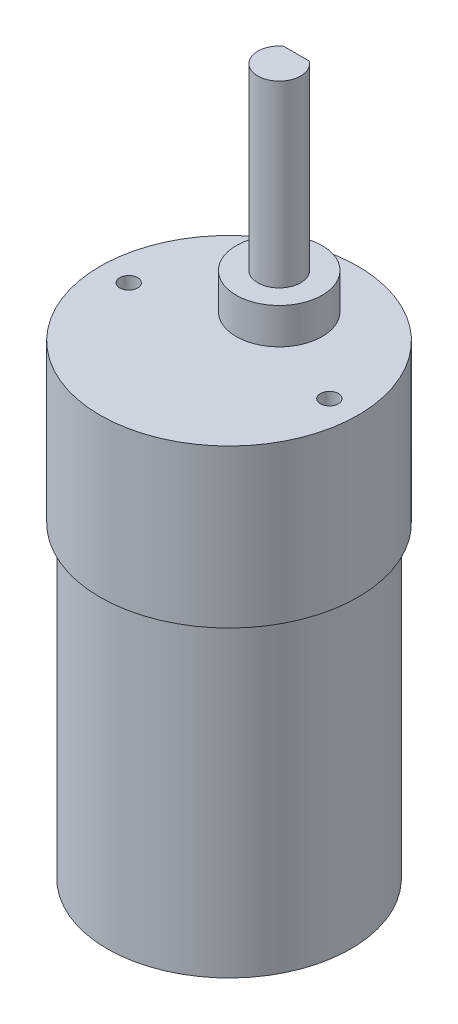
ISO-10303-21;
HEADER;
FILE_DESCRIPTION(('STEP AP214'),'2;1');
FILE_NAME('part.step','',(''),(''),'','','');
FILE_SCHEMA(('AUTOMOTIVE_DESIGN { 1 0 10303 214 1 1 1 1 }'));
ENDSEC;
DATA;
#1=APPLICATION_CONTEXT('core data for automotive mechanical design processes');
#2=APPLICATION_PROTOCOL_DEFINITION('international standard','automotive_design',2000,#1);
#3=PRODUCT_CONTEXT('',#1,'mechanical');
#4=PRODUCT('Part','Part','',(#3));
#5=PRODUCT_RELATED_PRODUCT_CATEGORY('part','',(#4));
#6=PRODUCT_DEFINITION_FORMATION('','',#4);
#7=PRODUCT_DEFINITION_CONTEXT('part definition',#1,'design');
#8=PRODUCT_DEFINITION('design','',#6,#7);
#9=PRODUCT_DEFINITION_SHAPE('','',#8);
#10=(LENGTH_UNIT() NAMED_UNIT(*) SI_UNIT(.MILLI.,.METRE.));
#11=(NAMED_UNIT(*) PLANE_ANGLE_UNIT() SI_UNIT($,.RADIAN.));
#12=(NAMED_UNIT(*) SI_UNIT($,.STERADIAN.) SOLID_ANGLE_UNIT());
#13=UNCERTAINTY_MEASURE_WITH_UNIT(LENGTH_MEASURE(1.E-05),#10,'distance_accuracy_value','');
#14=(GEOMETRIC_REPRESENTATION_CONTEXT(3) GLOBAL_UNCERTAINTY_ASSIGNED_CONTEXT((#13)) GLOBAL_UNIT_ASSIGNED_CONTEXT((#10,
#11,#12)) REPRESENTATION_CONTEXT('',''));
#15=CARTESIAN_POINT('',(0.,0.,0.));
#16=DIRECTION('',(0.,0.,1.));
#17=DIRECTION('',(1.,0.,0.));
#18=AXIS2_PLACEMENT_3D('',#15,#16,#17);
#19=CARTESIAN_POINT('',(0.,-1.,0.));
#20=DIRECTION('',(0.,-1.,0.));
#21=DIRECTION('',(0.,0.,-1.));
#22=AXIS2_PLACEMENT_3D('',#19,#20,#21);
#23=PLANE('',#22);
#24=CARTESIAN_POINT('',(0.,-1.,0.));
#25=DIRECTION('',(0.,-1.,0.));
#26=DIRECTION('',(0.,0.,-1.));
#27=AXIS2_PLACEMENT_3D('',#24,#25,#26);
#28=CIRCLE('',#27,5.);
#29=CARTESIAN_POINT('',(0.,-1.,-5.));
#30=VERTEX_POINT('',#29);
#31=EDGE_CURVE('E393',#30,#30,#28,.T.);
#32=ORIENTED_EDGE('',*,*,#31,.T.);
#33=EDGE_LOOP('',(#32));
#34=FACE_BOUND('',#33,.T.);
#35=CARTESIAN_POINT('',(0.,-1.,0.));
#36=DIRECTION('',(0.,-1.,0.));
#37=DIRECTION('',(0.,0.,-1.));
#38=AXIS2_PLACEMENT_3D('',#35,#36,#37);
#39=CIRCLE('',#38,3.25);
#40=CARTESIAN_POINT('',(0.,-1.,-3.25));
#41=VERTEX_POINT('',#40);
#42=EDGE_CURVE('E394',#41,#41,#39,.T.);
#43=ORIENTED_EDGE('',*,*,#42,.F.);
#44=EDGE_LOOP('',(#43));
#45=FACE_BOUND('',#44,.T.);
#46=ADVANCED_FACE('F33',(#34,#45),#23,.T.);
#47=CARTESIAN_POINT('',(0.,0.,0.));
#48=DIRECTION('',(0.,1.,0.));
#49=DIRECTION('',(0.,0.,1.));
#50=AXIS2_PLACEMENT_3D('',#47,#48,#49);
#51=PLANE('',#50);
#52=CARTESIAN_POINT('',(0.,0.,0.));
#53=DIRECTION('',(0.,1.,0.));
#54=DIRECTION('',(0.,0.,1.));
#55=AXIS2_PLACEMENT_3D('',#52,#53,#54);
#56=CIRCLE('',#55,17.);
#57=CARTESIAN_POINT('',(0.,0.,17.));
#58=VERTEX_POINT('',#57);
#59=EDGE_CURVE('E239',#58,#58,#56,.T.);
#60=ORIENTED_EDGE('',*,*,#59,.F.);
#61=EDGE_LOOP('',(#60));
#62=FACE_BOUND('',#61,.T.);
#63=DIRECTION('',(0.,0.,-1.));
#64=VECTOR('',#63,1.);
#65=CARTESIAN_POINT('',(-7.5,0.,-7.5));
#66=LINE('',#65,#64);
#67=CARTESIAN_POINT('',(-7.5,0.,-7.5));
#68=VERTEX_POINT('',#67);
#69=CARTESIAN_POINT('',(-7.5,0.,-12.5));
#70=VERTEX_POINT('',#69);
#71=EDGE_CURVE('E93',#68,#70,#66,.T.);
#72=ORIENTED_EDGE('',*,*,#71,.F.);
#73=DIRECTION('',(1.,0.,0.));
#74=VECTOR('',#73,1.);
#75=CARTESIAN_POINT('',(-7.5,0.,-7.5));
#76=LINE('',#75,#74);
#77=CARTESIAN_POINT('',(7.5,0.,-7.5));
#78=VERTEX_POINT('',#77);
#79=EDGE_CURVE('E242',#68,#78,#76,.T.);
#80=ORIENTED_EDGE('',*,*,#79,.T.);
#81=DIRECTION('',(0.,0.,-1.));
#82=VECTOR('',#81,1.);
#83=CARTESIAN_POINT('',(7.5,0.,-7.5));
#84=LINE('',#83,#82);
#85=CARTESIAN_POINT('',(7.5,0.,-12.5));
#86=VERTEX_POINT('',#85);
#87=EDGE_CURVE('E88',#78,#86,#84,.T.);
#88=ORIENTED_EDGE('',*,*,#87,.T.);
#89=DIRECTION('',(1.,0.,0.));
#90=VECTOR('',#89,1.);
#91=CARTESIAN_POINT('',(-7.5,0.,-12.5));
#92=LINE('',#91,#90);
#93=EDGE_CURVE('E270',#70,#86,#92,.T.);
#94=ORIENTED_EDGE('',*,*,#93,.F.);
#95=EDGE_LOOP('',(#72,#80,#88,#94));
#96=FACE_BOUND('',#95,.T.);
#97=CARTESIAN_POINT('',(0.,0.,0.));
#98=DIRECTION('',(0.,1.,0.));
#99=DIRECTION('',(0.,0.,1.));
#100=AXIS2_PLACEMENT_3D('',#97,#98,#99);
#101=CIRCLE('',#100,5.);
#102=CARTESIAN_POINT('',(0.,0.,5.));
#103=VERTEX_POINT('',#102);
#104=EDGE_CURVE('E11',#103,#103,#101,.F.);
#105=ORIENTED_EDGE('',*,*,#104,.F.);
#106=EDGE_LOOP('',(#105));
#107=FACE_BOUND('',#106,.T.);
#108=ADVANCED_FACE('F138',(#62,#96,#107),#51,.F.);
#109=CARTESIAN_POINT('',(0.,95.,-7.));
#110=DIRECTION('',(0.,1.,0.));
#111=DIRECTION('',(0.,0.,1.));
#112=AXIS2_PLACEMENT_3D('',#109,#110,#111);
#113=PLANE('',#112);
#114=CARTESIAN_POINT('',(0.,95.,-7.));
#115=DIRECTION('',(0.,1.,0.));
#116=DIRECTION('',(0.,0.,1.));
#117=AXIS2_PLACEMENT_3D('',#114,#115,#116);
#118=CIRCLE('',#117,3.);
#119=CARTESIAN_POINT('',(-1.8,95.,-9.4));
#120=VERTEX_POINT('',#119);
#121=CARTESIAN_POINT('',(1.8,95.,-9.4));
#122=VERTEX_POINT('',#121);
#123=EDGE_CURVE('E238',#120,#122,#118,.T.);
#124=ORIENTED_EDGE('',*,*,#123,.T.);
#125=DIRECTION('',(-1.,0.,0.));
#126=VECTOR('',#125,1.);
#127=CARTESIAN_POINT('',(0.,95.,-9.4));
#128=LINE('',#127,#126);
#129=EDGE_CURVE('E221',#122,#120,#128,.T.);
#130=ORIENTED_EDGE('',*,*,#129,.T.);
#131=EDGE_LOOP('',(#124,#130));
#132=FACE_BOUND('',#131,.T.);
#133=ADVANCED_FACE('F135',(#132),#113,.T.);
#134=CARTESIAN_POINT('',(0.,70.,-7.));
#135=DIRECTION('',(0.,1.,0.));
#136=DIRECTION('',(0.,0.,1.));
#137=AXIS2_PLACEMENT_3D('',#134,#135,#136);
#138=PLANE('',#137);
#139=CARTESIAN_POINT('',(0.,70.,-7.));
#140=DIRECTION('',(0.,1.,0.));
#141=DIRECTION('',(0.,0.,1.));
#142=AXIS2_PLACEMENT_3D('',#139,#140,#141);
#143=CIRCLE('',#142,6.);
#144=CARTESIAN_POINT('',(0.,70.,-0.999999999999999));
#145=VERTEX_POINT('',#144);
#146=EDGE_CURVE('E237',#145,#145,#143,.T.);
#147=ORIENTED_EDGE('',*,*,#146,.T.);
#148=EDGE_LOOP('',(#147));
#149=FACE_BOUND('',#148,.T.);
#150=CARTESIAN_POINT('',(0.,70.,-7.));
#151=DIRECTION('',(0.,1.,0.));
#152=DIRECTION('',(0.,0.,1.));
#153=AXIS2_PLACEMENT_3D('',#150,#151,#152);
#154=CIRCLE('',#153,3.);
#155=CARTESIAN_POINT('',(0.,70.,-4.));
#156=VERTEX_POINT('',#155);
#157=EDGE_CURVE('E229',#156,#156,#154,.T.);
#158=ORIENTED_EDGE('',*,*,#157,.F.);
#159=EDGE_LOOP('',(#158));
#160=FACE_BOUND('',#159,.T.);
#161=ADVANCED_FACE('F137',(#149,#160),#138,.T.);
#162=CARTESIAN_POINT('',(0.,65.,0.));
#163=DIRECTION('',(0.,1.,0.));
#164=DIRECTION('',(0.,0.,1.));
#165=AXIS2_PLACEMENT_3D('',#162,#163,#164);
#166=PLANE('',#165);
#167=CARTESIAN_POINT('',(-14.,65.,0.));
#168=DIRECTION('',(0.,1.,0.));
#169=DIRECTION('',(0.,0.,1.));
#170=AXIS2_PLACEMENT_3D('',#167,#168,#169);
#171=CIRCLE('',#170,1.25);
#172=CARTESIAN_POINT('',(-14.,65.,1.25));
#173=VERTEX_POINT('',#172);
#174=EDGE_CURVE('E111',#173,#173,#171,.T.);
#175=ORIENTED_EDGE('',*,*,#174,.F.);
#176=EDGE_LOOP('',(#175));
#177=FACE_BOUND('',#176,.T.);
#178=CARTESIAN_POINT('',(14.,65.,0.));
#179=DIRECTION('',(0.,1.,0.));
#180=DIRECTION('',(0.,0.,1.));
#181=AXIS2_PLACEMENT_3D('',#178,#179,#180);
#182=CIRCLE('',#181,1.25);
#183=CARTESIAN_POINT('',(14.,65.,1.25));
#184=VERTEX_POINT('',#183);
#185=EDGE_CURVE('E258',#184,#184,#182,.T.);
#186=ORIENTED_EDGE('',*,*,#185,.F.);
#187=EDGE_LOOP('',(#186));
#188=FACE_BOUND('',#187,.T.);
#189=CARTESIAN_POINT('',(0.,65.,0.));
#190=DIRECTION('',(0.,1.,0.));
#191=DIRECTION('',(0.,0.,1.));
#192=AXIS2_PLACEMENT_3D('',#189,#190,#191);
#193=CIRCLE('',#192,18.);
#194=CARTESIAN_POINT('',(0.,65.,18.));
#195=VERTEX_POINT('',#194);
#196=EDGE_CURVE('E243',#195,#195,#193,.T.);
#197=ORIENTED_EDGE('',*,*,#196,.T.);
#198=EDGE_LOOP('',(#197));
#199=FACE_BOUND('',#198,.T.);
#200=CARTESIAN_POINT('',(0.,65.,-7.));
#201=DIRECTION('',(0.,1.,0.));
#202=DIRECTION('',(0.,0.,1.));
#203=AXIS2_PLACEMENT_3D('',#200,#201,#202);
#204=CIRCLE('',#203,6.);
#205=CARTESIAN_POINT('',(0.,65.,-0.999999999999999));
#206=VERTEX_POINT('',#205);
#207=EDGE_CURVE('E230',#206,#206,#204,.T.);
#208=ORIENTED_EDGE('',*,*,#207,.F.);
#209=EDGE_LOOP('',(#208));
#210=FACE_BOUND('',#209,.T.);
#211=ADVANCED_FACE('F144',(#177,#188,#199,#210),#166,.T.);
#212=CARTESIAN_POINT('',(0.,43.,0.));
#213=DIRECTION('',(0.,-1.,0.));
#214=DIRECTION('',(0.,0.,-1.));
#215=AXIS2_PLACEMENT_3D('',#212,#213,#214);
#216=CYLINDRICAL_SURFACE('',#215,17.);
#217=CARTESIAN_POINT('',(0.,43.,0.));
#218=DIRECTION('',(0.,1.,0.));
#219=DIRECTION('',(0.,0.,1.));
#220=AXIS2_PLACEMENT_3D('',#217,#218,#219);
#221=CIRCLE('',#220,17.);
#222=CARTESIAN_POINT('',(0.,43.,17.));
#223=VERTEX_POINT('',#222);
#224=EDGE_CURVE('E244',#223,#223,#221,.T.);
#225=ORIENTED_EDGE('',*,*,#224,.F.);
#226=EDGE_LOOP('',(#225));
#227=FACE_BOUND('',#226,.T.);
#228=ORIENTED_EDGE('',*,*,#59,.T.);
#229=EDGE_LOOP('',(#228));
#230=FACE_BOUND('',#229,.T.);
#231=ADVANCED_FACE('F164',(#227,#230),#216,.T.);
#232=CARTESIAN_POINT('',(0.,43.,0.));
#233=DIRECTION('',(0.,1.,0.));
#234=DIRECTION('',(0.,0.,1.));
#235=AXIS2_PLACEMENT_3D('',#232,#233,#234);
#236=PLANE('',#235);
#237=CARTESIAN_POINT('',(0.,43.,0.));
#238=DIRECTION('',(0.,1.,0.));
#239=DIRECTION('',(0.,0.,1.));
#240=AXIS2_PLACEMENT_3D('',#237,#238,#239);
#241=CIRCLE('',#240,18.);
#242=CARTESIAN_POINT('',(0.,43.,18.));
#243=VERTEX_POINT('',#242);
#244=EDGE_CURVE('E247',#243,#243,#241,.T.);
#245=ORIENTED_EDGE('',*,*,#244,.F.);
#246=EDGE_LOOP('',(#245));
#247=FACE_BOUND('',#246,.T.);
#248=ORIENTED_EDGE('',*,*,#224,.T.);
#249=EDGE_LOOP('',(#248));
#250=FACE_BOUND('',#249,.T.);
#251=ADVANCED_FACE('F166',(#247,#250),#236,.F.);
#252=CARTESIAN_POINT('',(0.,65.,0.));
#253=DIRECTION('',(0.,-1.,0.));
#254=DIRECTION('',(0.,0.,-1.));
#255=AXIS2_PLACEMENT_3D('',#252,#253,#254);
#256=CYLINDRICAL_SURFACE('',#255,18.);
#257=ORIENTED_EDGE('',*,*,#196,.F.);
#258=EDGE_LOOP('',(#257));
#259=FACE_BOUND('',#258,.T.);
#260=ORIENTED_EDGE('',*,*,#244,.T.);
#261=EDGE_LOOP('',(#260));
#262=FACE_BOUND('',#261,.T.);
#263=ADVANCED_FACE('F169',(#259,#262),#256,.T.);
#264=CARTESIAN_POINT('',(0.,70.,-7.));
#265=DIRECTION('',(0.,-1.,0.));
#266=DIRECTION('',(0.,0.,-1.));
#267=AXIS2_PLACEMENT_3D('',#264,#265,#266);
#268=CYLINDRICAL_SURFACE('',#267,6.);
#269=ORIENTED_EDGE('',*,*,#146,.F.);
#270=EDGE_LOOP('',(#269));
#271=FACE_BOUND('',#270,.T.);
#272=ORIENTED_EDGE('',*,*,#207,.T.);
#273=EDGE_LOOP('',(#272));
#274=FACE_BOUND('',#273,.T.);
#275=ADVANCED_FACE('F172',(#271,#274),#268,.T.);
#276=CARTESIAN_POINT('',(0.,95.,-7.));
#277=DIRECTION('',(0.,-1.,0.));
#278=DIRECTION('',(0.,0.,-1.));
#279=AXIS2_PLACEMENT_3D('',#276,#277,#278);
#280=CYLINDRICAL_SURFACE('',#279,3.);
#281=DIRECTION('',(0.,-1.,0.));
#282=VECTOR('',#281,1.);
#283=CARTESIAN_POINT('',(-1.8,95.,-9.4));
#284=LINE('',#283,#282);
#285=CARTESIAN_POINT('',(-1.8,73.,-9.4));
#286=VERTEX_POINT('',#285);
#287=EDGE_CURVE('E118',#286,#120,#284,.F.);
#288=ORIENTED_EDGE('',*,*,#287,.F.);
#289=CARTESIAN_POINT('',(0.,73.,-7.));
#290=DIRECTION('',(0.,-1.,0.));
#291=DIRECTION('',(-0.6,0.,-0.8));
#292=AXIS2_PLACEMENT_3D('',#289,#290,#291);
#293=CIRCLE('',#292,3.);
#294=CARTESIAN_POINT('',(1.8,73.,-9.4));
#295=VERTEX_POINT('',#294);
#296=EDGE_CURVE('E226',#286,#295,#293,.T.);
#297=ORIENTED_EDGE('',*,*,#296,.T.);
#298=DIRECTION('',(0.,-1.,0.));
#299=VECTOR('',#298,1.);
#300=CARTESIAN_POINT('',(1.8,95.,-9.4));
#301=LINE('',#300,#299);
#302=EDGE_CURVE('E218',#122,#295,#301,.T.);
#303=ORIENTED_EDGE('',*,*,#302,.F.);
#304=ORIENTED_EDGE('',*,*,#123,.F.);
#305=EDGE_LOOP('',(#288,#297,#303,#304));
#306=FACE_BOUND('',#305,.T.);
#307=ORIENTED_EDGE('',*,*,#157,.T.);
#308=EDGE_LOOP('',(#307));
#309=FACE_BOUND('',#308,.T.);
#310=ADVANCED_FACE('F35',(#306,#309),#280,.T.);
#311=CARTESIAN_POINT('',(14.,60.,0.));
#312=DIRECTION('',(0.,1.,0.));
#313=DIRECTION('',(0.,0.,1.));
#314=AXIS2_PLACEMENT_3D('',#311,#312,#313);
#315=CYLINDRICAL_SURFACE('',#314,1.25);
#316=CARTESIAN_POINT('',(14.,60.,0.));
#317=DIRECTION('',(0.,1.,0.));
#318=DIRECTION('',(0.,0.,1.));
#319=AXIS2_PLACEMENT_3D('',#316,#317,#318);
#320=CIRCLE('',#319,1.25);
#321=CARTESIAN_POINT('',(14.,60.,1.25));
#322=VERTEX_POINT('',#321);
#323=EDGE_CURVE('E261',#322,#322,#320,.T.);
#324=ORIENTED_EDGE('',*,*,#323,.F.);
#325=EDGE_LOOP('',(#324));
#326=FACE_BOUND('',#325,.T.);
#327=ORIENTED_EDGE('',*,*,#185,.T.);
#328=EDGE_LOOP('',(#327));
#329=FACE_BOUND('',#328,.T.);
#330=ADVANCED_FACE('F183',(#326,#329),#315,.F.);
#331=CARTESIAN_POINT('',(14.,60.,0.));
#332=DIRECTION('',(0.,1.,0.));
#333=DIRECTION('',(0.,0.,1.));
#334=AXIS2_PLACEMENT_3D('',#331,#332,#333);
#335=PLANE('',#334);
#336=ORIENTED_EDGE('',*,*,#323,.T.);
#337=EDGE_LOOP('',(#336));
#338=FACE_BOUND('',#337,.T.);
#339=ADVANCED_FACE('F186',(#338),#335,.T.);
#340=CARTESIAN_POINT('',(-14.,60.,0.));
#341=DIRECTION('',(0.,1.,0.));
#342=DIRECTION('',(0.,0.,1.));
#343=AXIS2_PLACEMENT_3D('',#340,#341,#342);
#344=CYLINDRICAL_SURFACE('',#343,1.25);
#345=CARTESIAN_POINT('',(-14.,60.,0.));
#346=DIRECTION('',(0.,1.,0.));
#347=DIRECTION('',(0.,0.,1.));
#348=AXIS2_PLACEMENT_3D('',#345,#346,#347);
#349=CIRCLE('',#348,1.25);
#350=CARTESIAN_POINT('',(-14.,60.,1.25));
#351=VERTEX_POINT('',#350);
#352=EDGE_CURVE('E108',#351,#351,#349,.T.);
#353=ORIENTED_EDGE('',*,*,#352,.F.);
#354=EDGE_LOOP('',(#353));
#355=FACE_BOUND('',#354,.T.);
#356=ORIENTED_EDGE('',*,*,#174,.T.);
#357=EDGE_LOOP('',(#356));
#358=FACE_BOUND('',#357,.T.);
#359=ADVANCED_FACE('F190',(#355,#358),#344,.F.);
#360=CARTESIAN_POINT('',(-14.,60.,0.));
#361=DIRECTION('',(0.,1.,0.));
#362=DIRECTION('',(0.,0.,1.));
#363=AXIS2_PLACEMENT_3D('',#360,#361,#362);
#364=PLANE('',#363);
#365=ORIENTED_EDGE('',*,*,#352,.T.);
#366=EDGE_LOOP('',(#365));
#367=FACE_BOUND('',#366,.T.);
#368=ADVANCED_FACE('F194',(#367),#364,.T.);
#369=CARTESIAN_POINT('',(-7.5,-5.,-7.5));
#370=DIRECTION('',(0.,0.,1.));
#371=DIRECTION('',(1.,0.,0.));
#372=AXIS2_PLACEMENT_3D('',#369,#370,#371);
#373=PLANE('',#372);
#374=ORIENTED_EDGE('',*,*,#79,.F.);
#375=DIRECTION('',(0.,1.,0.));
#376=VECTOR('',#375,1.);
#377=CARTESIAN_POINT('',(-7.5,-5.,-7.5));
#378=LINE('',#377,#376);
#379=CARTESIAN_POINT('',(-7.5,-5.,-7.5));
#380=VERTEX_POINT('',#379);
#381=EDGE_CURVE('E106',#380,#68,#378,.T.);
#382=ORIENTED_EDGE('',*,*,#381,.F.);
#383=DIRECTION('',(1.,0.,0.));
#384=VECTOR('',#383,1.);
#385=CARTESIAN_POINT('',(-7.5,-5.,-7.5));
#386=LINE('',#385,#384);
#387=CARTESIAN_POINT('',(7.5,-5.,-7.5));
#388=VERTEX_POINT('',#387);
#389=EDGE_CURVE('E94',#380,#388,#386,.T.);
#390=ORIENTED_EDGE('',*,*,#389,.T.);
#391=DIRECTION('',(0.,1.,0.));
#392=VECTOR('',#391,1.);
#393=CARTESIAN_POINT('',(7.5,-5.,-7.5));
#394=LINE('',#393,#392);
#395=EDGE_CURVE('E82',#388,#78,#394,.T.);
#396=ORIENTED_EDGE('',*,*,#395,.T.);
#397=EDGE_LOOP('',(#374,#382,#390,#396));
#398=FACE_BOUND('',#397,.T.);
#399=ADVANCED_FACE('F105',(#398),#373,.T.);
#400=CARTESIAN_POINT('',(-7.5,-5.,-7.5));
#401=DIRECTION('',(1.,0.,0.));
#402=DIRECTION('',(0.,0.,-1.));
#403=AXIS2_PLACEMENT_3D('',#400,#401,#402);
#404=PLANE('',#403);
#405=ORIENTED_EDGE('',*,*,#71,.T.);
#406=DIRECTION('',(0.,1.,0.));
#407=VECTOR('',#406,1.);
#408=CARTESIAN_POINT('',(-7.5,-5.,-12.5));
#409=LINE('',#408,#407);
#410=CARTESIAN_POINT('',(-7.5,-5.,-12.5));
#411=VERTEX_POINT('',#410);
#412=EDGE_CURVE('E103',#411,#70,#409,.T.);
#413=ORIENTED_EDGE('',*,*,#412,.F.);
#414=DIRECTION('',(0.,0.,-1.));
#415=VECTOR('',#414,1.);
#416=CARTESIAN_POINT('',(-7.5,-5.,-7.5));
#417=LINE('',#416,#415);
#418=EDGE_CURVE('E267',#380,#411,#417,.T.);
#419=ORIENTED_EDGE('',*,*,#418,.F.);
#420=ORIENTED_EDGE('',*,*,#381,.T.);
#421=EDGE_LOOP('',(#405,#413,#419,#420));
#422=FACE_BOUND('',#421,.T.);
#423=ADVANCED_FACE('F201',(#422),#404,.F.);
#424=CARTESIAN_POINT('',(-7.5,-5.,-12.5));
#425=DIRECTION('',(0.,0.,1.));
#426=DIRECTION('',(1.,0.,0.));
#427=AXIS2_PLACEMENT_3D('',#424,#425,#426);
#428=PLANE('',#427);
#429=ORIENTED_EDGE('',*,*,#93,.T.);
#430=DIRECTION('',(0.,1.,0.));
#431=VECTOR('',#430,1.);
#432=CARTESIAN_POINT('',(7.5,-5.,-12.5));
#433=LINE('',#432,#431);
#434=CARTESIAN_POINT('',(7.5,-5.,-12.5));
#435=VERTEX_POINT('',#434);
#436=EDGE_CURVE('E102',#435,#86,#433,.T.);
#437=ORIENTED_EDGE('',*,*,#436,.F.);
#438=DIRECTION('',(1.,0.,0.));
#439=VECTOR('',#438,1.);
#440=CARTESIAN_POINT('',(-7.5,-5.,-12.5));
#441=LINE('',#440,#439);
#442=EDGE_CURVE('E100',#411,#435,#441,.T.);
#443=ORIENTED_EDGE('',*,*,#442,.F.);
#444=ORIENTED_EDGE('',*,*,#412,.T.);
#445=EDGE_LOOP('',(#429,#437,#443,#444));
#446=FACE_BOUND('',#445,.T.);
#447=ADVANCED_FACE('F204',(#446),#428,.F.);
#448=CARTESIAN_POINT('',(7.5,-5.,-7.5));
#449=DIRECTION('',(1.,0.,0.));
#450=DIRECTION('',(0.,0.,-1.));
#451=AXIS2_PLACEMENT_3D('',#448,#449,#450);
#452=PLANE('',#451);
#453=ORIENTED_EDGE('',*,*,#87,.F.);
#454=ORIENTED_EDGE('',*,*,#395,.F.);
#455=DIRECTION('',(0.,0.,-1.));
#456=VECTOR('',#455,1.);
#457=CARTESIAN_POINT('',(7.5,-5.,-7.5));
#458=LINE('',#457,#456);
#459=EDGE_CURVE('E86',#388,#435,#458,.T.);
#460=ORIENTED_EDGE('',*,*,#459,.T.);
#461=ORIENTED_EDGE('',*,*,#436,.T.);
#462=EDGE_LOOP('',(#453,#454,#460,#461));
#463=FACE_BOUND('',#462,.T.);
#464=ADVANCED_FACE('F84',(#463),#452,.T.);
#465=CARTESIAN_POINT('',(0.,-5.,0.));
#466=DIRECTION('',(0.,1.,0.));
#467=DIRECTION('',(0.,0.,1.));
#468=AXIS2_PLACEMENT_3D('',#465,#466,#467);
#469=PLANE('',#468);
#470=ORIENTED_EDGE('',*,*,#389,.F.);
#471=ORIENTED_EDGE('',*,*,#418,.T.);
#472=ORIENTED_EDGE('',*,*,#442,.T.);
#473=ORIENTED_EDGE('',*,*,#459,.F.);
#474=EDGE_LOOP('',(#470,#471,#472,#473));
#475=FACE_BOUND('',#474,.T.);
#476=ADVANCED_FACE('F98',(#475),#469,.F.);
#477=CARTESIAN_POINT('',(0.,105.,-9.4));
#478=DIRECTION('',(0.,0.,-1.));
#479=DIRECTION('',(-1.,0.,0.));
#480=AXIS2_PLACEMENT_3D('',#477,#478,#479);
#481=PLANE('',#480);
#482=ORIENTED_EDGE('',*,*,#302,.T.);
#483=DIRECTION('',(1.,0.,0.));
#484=VECTOR('',#483,1.);
#485=CARTESIAN_POINT('',(0.,73.,-9.4));
#486=LINE('',#485,#484);
#487=EDGE_CURVE('E43',#286,#295,#486,.T.);
#488=ORIENTED_EDGE('',*,*,#487,.F.);
#489=ORIENTED_EDGE('',*,*,#287,.T.);
#490=ORIENTED_EDGE('',*,*,#129,.F.);
#491=EDGE_LOOP('',(#482,#488,#489,#490));
#492=FACE_BOUND('',#491,.T.);
#493=ADVANCED_FACE('F133',(#492),#481,.T.);
#494=CARTESIAN_POINT('',(0.,73.,0.));
#495=DIRECTION('',(0.,1.,0.));
#496=DIRECTION('',(0.,0.,1.));
#497=AXIS2_PLACEMENT_3D('',#494,#495,#496);
#498=PLANE('',#497);
#499=ORIENTED_EDGE('',*,*,#296,.F.);
#500=ORIENTED_EDGE('',*,*,#487,.T.);
#501=EDGE_LOOP('',(#499,#500));
#502=FACE_BOUND('',#501,.T.);
#503=ADVANCED_FACE('F123',(#502),#498,.T.);
#504=CARTESIAN_POINT('',(0.,-1.,0.));
#505=DIRECTION('',(0.,1.,0.));
#506=DIRECTION('',(0.,0.,1.));
#507=AXIS2_PLACEMENT_3D('',#504,#505,#506);
#508=CYLINDRICAL_SURFACE('',#507,5.);
#509=ORIENTED_EDGE('',*,*,#31,.F.);
#510=EDGE_LOOP('',(#509));
#511=FACE_BOUND('',#510,.T.);
#512=ORIENTED_EDGE('',*,*,#104,.T.);
#513=EDGE_LOOP('',(#512));
#514=FACE_BOUND('',#513,.T.);
#515=ADVANCED_FACE('F132',(#511,#514),#508,.T.);
#516=CARTESIAN_POINT('',(0.,-5.,0.));
#517=DIRECTION('',(0.,1.,0.));
#518=DIRECTION('',(0.,0.,1.));
#519=AXIS2_PLACEMENT_3D('',#516,#517,#518);
#520=CYLINDRICAL_SURFACE('',#519,3.25);
#521=CARTESIAN_POINT('',(0.,-5.,0.));
#522=DIRECTION('',(0.,-1.,0.));
#523=DIRECTION('',(0.,0.,-1.));
#524=AXIS2_PLACEMENT_3D('',#521,#522,#523);
#525=CIRCLE('',#524,3.25);
#526=CARTESIAN_POINT('',(0.,-5.,-3.25));
#527=VERTEX_POINT('',#526);
#528=EDGE_CURVE('E392',#527,#527,#525,.T.);
#529=ORIENTED_EDGE('',*,*,#528,.F.);
#530=EDGE_LOOP('',(#529));
#531=FACE_BOUND('',#530,.T.);
#532=ORIENTED_EDGE('',*,*,#42,.T.);
#533=EDGE_LOOP('',(#532));
#534=FACE_BOUND('',#533,.T.);
#535=ADVANCED_FACE('F159',(#531,#534),#520,.T.);
#536=CARTESIAN_POINT('',(0.,-5.,0.));
#537=DIRECTION('',(0.,-1.,0.));
#538=DIRECTION('',(0.,0.,-1.));
#539=AXIS2_PLACEMENT_3D('',#536,#537,#538);
#540=PLANE('',#539);
#541=ORIENTED_EDGE('',*,*,#528,.T.);
#542=EDGE_LOOP('',(#541));
#543=FACE_BOUND('',#542,.T.);
#544=ADVANCED_FACE('F378',(#543),#540,.T.);
#545=CLOSED_SHELL('',(#46,#108,#133,#161,#211,#231,#251,#263,#275,#310,#330,#339,#359,#368,#399,
#423,#447,#464,#476,#493,#503,#515,#535,#544));
#546=MANIFOLD_SOLID_BREP('B2',#545);
#547=ADVANCED_BREP_SHAPE_REPRESENTATION('',(#18,#546),#14);
#548=SHAPE_DEFINITION_REPRESENTATION(#9,#547);
ENDSEC;
END-ISO-10303-21;
